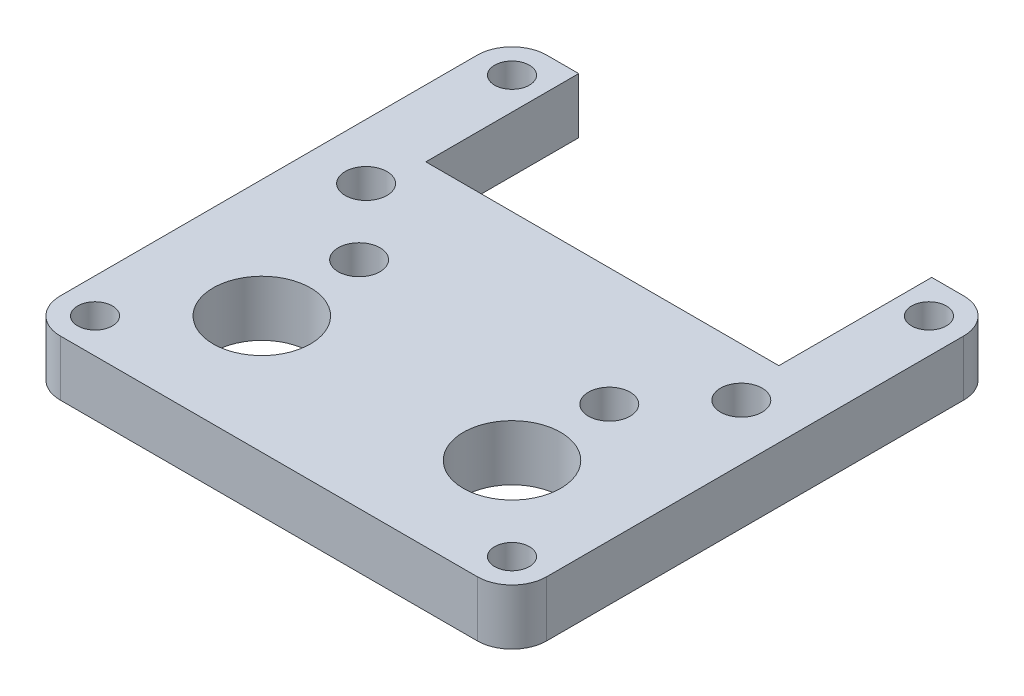
ISO-10303-21;
HEADER;
FILE_DESCRIPTION(('STEP AP214'),'2;1');
FILE_NAME('part.step','',(''),(''),'','','');
FILE_SCHEMA(('AUTOMOTIVE_DESIGN { 1 0 10303 214 1 1 1 1 }'));
ENDSEC;
DATA;
#1=APPLICATION_CONTEXT('core data for automotive mechanical design processes');
#2=APPLICATION_PROTOCOL_DEFINITION('international standard','automotive_design',2000,#1);
#3=PRODUCT_CONTEXT('',#1,'mechanical');
#4=PRODUCT('Part','Part','',(#3));
#5=PRODUCT_RELATED_PRODUCT_CATEGORY('part','',(#4));
#6=PRODUCT_DEFINITION_FORMATION('','',#4);
#7=PRODUCT_DEFINITION_CONTEXT('part definition',#1,'design');
#8=PRODUCT_DEFINITION('design','',#6,#7);
#9=PRODUCT_DEFINITION_SHAPE('','',#8);
#10=(LENGTH_UNIT() NAMED_UNIT(*) SI_UNIT(.MILLI.,.METRE.));
#11=(NAMED_UNIT(*) PLANE_ANGLE_UNIT() SI_UNIT($,.RADIAN.));
#12=(NAMED_UNIT(*) SI_UNIT($,.STERADIAN.) SOLID_ANGLE_UNIT());
#13=UNCERTAINTY_MEASURE_WITH_UNIT(LENGTH_MEASURE(1.E-05),#10,'distance_accuracy_value','');
#14=(GEOMETRIC_REPRESENTATION_CONTEXT(3) GLOBAL_UNCERTAINTY_ASSIGNED_CONTEXT((#13)) GLOBAL_UNIT_ASSIGNED_CONTEXT((#10,
#11,#12)) REPRESENTATION_CONTEXT('',''));
#15=CARTESIAN_POINT('',(0.,0.,0.));
#16=DIRECTION('',(0.,0.,1.));
#17=DIRECTION('',(1.,0.,0.));
#18=AXIS2_PLACEMENT_3D('',#15,#16,#17);
#19=CARTESIAN_POINT('',(-10.2,2.,-1.49999999996453));
#20=DIRECTION('',(0.,0.,-1.));
#21=DIRECTION('',(-1.,0.,0.));
#22=AXIS2_PLACEMENT_3D('',#19,#20,#21);
#23=CONICAL_SURFACE('',#22,1.02499999996762,1.02974425866215);
#24=CARTESIAN_POINT('',(-10.2,2.,-0.884117865496137));
#25=VERTEX_POINT('',#24);
#26=VERTEX_LOOP('',#25);
#27=FACE_BOUND('',#26,.T.);
#28=CARTESIAN_POINT('',(-10.2,2.,-1.5));
#29=DIRECTION('',(0.,0.,-1.));
#30=DIRECTION('',(-1.,0.,0.));
#31=AXIS2_PLACEMENT_3D('',#28,#29,#30);
#32=CIRCLE('',#31,1.025);
#33=CARTESIAN_POINT('',(-11.225,2.,-1.5));
#34=VERTEX_POINT('',#33);
#35=EDGE_CURVE('E147',#34,#34,#32,.T.);
#36=ORIENTED_EDGE('',*,*,#35,.T.);
#37=EDGE_LOOP('',(#36));
#38=FACE_BOUND('',#37,.T.);
#39=ADVANCED_FACE('F26',(#27,#38),#23,.F.);
#40=CARTESIAN_POINT('',(10.2,2.,-1.50000000002137));
#41=DIRECTION('',(0.,0.,-1.));
#42=DIRECTION('',(0.,1.,0.));
#43=AXIS2_PLACEMENT_3D('',#40,#41,#42);
#44=CONICAL_SURFACE('',#43,1.02500000002938,1.02974425867249);
#45=CARTESIAN_POINT('',(10.2,2.,-0.884117865496137));
#46=VERTEX_POINT('',#45);
#47=VERTEX_LOOP('',#46);
#48=FACE_BOUND('',#47,.T.);
#49=CARTESIAN_POINT('',(10.2,2.,-1.5));
#50=DIRECTION('',(0.,0.,-1.));
#51=DIRECTION('',(-1.,0.,0.));
#52=AXIS2_PLACEMENT_3D('',#49,#50,#51);
#53=CIRCLE('',#52,1.025);
#54=CARTESIAN_POINT('',(9.175,2.,-1.5));
#55=VERTEX_POINT('',#54);
#56=EDGE_CURVE('E150',#55,#55,#53,.T.);
#57=ORIENTED_EDGE('',*,*,#56,.T.);
#58=EDGE_LOOP('',(#57));
#59=FACE_BOUND('',#58,.T.);
#60=ADVANCED_FACE('F144',(#48,#59),#44,.F.);
#61=CARTESIAN_POINT('',(-10.2,2.,-6.5));
#62=DIRECTION('',(0.,0.,-1.));
#63=DIRECTION('',(-1.,0.,0.));
#64=AXIS2_PLACEMENT_3D('',#61,#62,#63);
#65=CYLINDRICAL_SURFACE('',#64,1.025);
#66=ORIENTED_EDGE('',*,*,#35,.F.);
#67=EDGE_LOOP('',(#66));
#68=FACE_BOUND('',#67,.T.);
#69=CARTESIAN_POINT('',(-10.2,2.,-6.5));
#70=DIRECTION('',(0.,0.,-1.));
#71=DIRECTION('',(-1.,0.,0.));
#72=AXIS2_PLACEMENT_3D('',#69,#70,#71);
#73=CIRCLE('',#72,1.025);
#74=CARTESIAN_POINT('',(-11.225,2.,-6.5));
#75=VERTEX_POINT('',#74);
#76=EDGE_CURVE('E243',#75,#75,#73,.T.);
#77=ORIENTED_EDGE('',*,*,#76,.T.);
#78=EDGE_LOOP('',(#77));
#79=FACE_BOUND('',#78,.T.);
#80=ADVANCED_FACE('F394',(#68,#79),#65,.F.);
#81=CARTESIAN_POINT('',(10.2,2.,-6.5));
#82=DIRECTION('',(0.,0.,-1.));
#83=DIRECTION('',(-1.,0.,0.));
#84=AXIS2_PLACEMENT_3D('',#81,#82,#83);
#85=CYLINDRICAL_SURFACE('',#84,1.025);
#86=ORIENTED_EDGE('',*,*,#56,.F.);
#87=EDGE_LOOP('',(#86));
#88=FACE_BOUND('',#87,.T.);
#89=CARTESIAN_POINT('',(10.2,2.,-6.5));
#90=DIRECTION('',(0.,0.,-1.));
#91=DIRECTION('',(-1.,0.,0.));
#92=AXIS2_PLACEMENT_3D('',#89,#90,#91);
#93=CIRCLE('',#92,1.025);
#94=CARTESIAN_POINT('',(9.175,2.,-6.5));
#95=VERTEX_POINT('',#94);
#96=EDGE_CURVE('E238',#95,#95,#93,.T.);
#97=ORIENTED_EDGE('',*,*,#96,.T.);
#98=EDGE_LOOP('',(#97));
#99=FACE_BOUND('',#98,.T.);
#100=ADVANCED_FACE('F390',(#88,#99),#85,.F.);
#101=CARTESIAN_POINT('',(17.5,0.,-17.5));
#102=DIRECTION('',(0.,-1.,0.));
#103=DIRECTION('',(0.,0.,-1.));
#104=AXIS2_PLACEMENT_3D('',#101,#102,#103);
#105=PLANE('',#104);
#106=CARTESIAN_POINT('',(-8.99999999999979,0.,9.));
#107=DIRECTION('',(0.,1.,0.));
#108=DIRECTION('',(0.,0.,1.));
#109=AXIS2_PLACEMENT_3D('',#106,#107,#108);
#110=CIRCLE('',#109,3.5);
#111=CARTESIAN_POINT('',(-8.99999999999979,0.,12.5));
#112=VERTEX_POINT('',#111);
#113=EDGE_CURVE('E248',#112,#112,#110,.T.);
#114=ORIENTED_EDGE('',*,*,#113,.T.);
#115=EDGE_LOOP('',(#114));
#116=FACE_BOUND('',#115,.T.);
#117=CARTESIAN_POINT('',(9.00000000000021,0.,9.));
#118=DIRECTION('',(0.,1.,0.));
#119=DIRECTION('',(0.,0.,1.));
#120=AXIS2_PLACEMENT_3D('',#117,#118,#119);
#121=CIRCLE('',#120,3.5);
#122=CARTESIAN_POINT('',(9.00000000000021,0.,12.5));
#123=VERTEX_POINT('',#122);
#124=EDGE_CURVE('E252',#123,#123,#121,.T.);
#125=ORIENTED_EDGE('',*,*,#124,.T.);
#126=EDGE_LOOP('',(#125));
#127=FACE_BOUND('',#126,.T.);
#128=DIRECTION('',(-1.,0.,0.));
#129=VECTOR('',#128,1.);
#130=CARTESIAN_POINT('',(-17.5,0.,17.5));
#131=LINE('',#130,#129);
#132=CARTESIAN_POINT('',(15.,0.,17.5));
#133=VERTEX_POINT('',#132);
#134=CARTESIAN_POINT('',(-15.,0.,17.5));
#135=VERTEX_POINT('',#134);
#136=EDGE_CURVE('E229',#133,#135,#131,.T.);
#137=ORIENTED_EDGE('',*,*,#136,.T.);
#138=CARTESIAN_POINT('',(-15.,0.,15.));
#139=DIRECTION('',(0.,-1.,0.));
#140=DIRECTION('',(0.,0.,-1.));
#141=AXIS2_PLACEMENT_3D('',#138,#139,#140);
#142=CIRCLE('',#141,2.5);
#143=CARTESIAN_POINT('',(-17.5,0.,15.));
#144=VERTEX_POINT('',#143);
#145=EDGE_CURVE('E225',#144,#135,#142,.F.);
#146=ORIENTED_EDGE('',*,*,#145,.F.);
#147=DIRECTION('',(0.,0.,-1.));
#148=VECTOR('',#147,1.);
#149=CARTESIAN_POINT('',(-17.5,0.,17.5));
#150=LINE('',#149,#148);
#151=CARTESIAN_POINT('',(-17.5,0.,-15.));
#152=VERTEX_POINT('',#151);
#153=EDGE_CURVE('E224',#144,#152,#150,.T.);
#154=ORIENTED_EDGE('',*,*,#153,.T.);
#155=CARTESIAN_POINT('',(-15.,0.,-15.));
#156=DIRECTION('',(0.,-1.,0.));
#157=DIRECTION('',(0.,0.,-1.));
#158=AXIS2_PLACEMENT_3D('',#155,#156,#157);
#159=CIRCLE('',#158,2.5);
#160=CARTESIAN_POINT('',(-15.,0.,-17.5));
#161=VERTEX_POINT('',#160);
#162=EDGE_CURVE('E220',#161,#152,#159,.F.);
#163=ORIENTED_EDGE('',*,*,#162,.F.);
#164=DIRECTION('',(1.,0.,0.));
#165=VECTOR('',#164,1.);
#166=CARTESIAN_POINT('',(-17.5,0.,-17.5));
#167=LINE('',#166,#165);
#168=CARTESIAN_POINT('',(-12.7,0.,-17.5));
#169=VERTEX_POINT('',#168);
#170=EDGE_CURVE('E219',#161,#169,#167,.T.);
#171=ORIENTED_EDGE('',*,*,#170,.T.);
#172=DIRECTION('',(0.,0.,1.));
#173=VECTOR('',#172,1.);
#174=CARTESIAN_POINT('',(-12.7,0.,-17.5));
#175=LINE('',#174,#173);
#176=CARTESIAN_POINT('',(-12.7,0.,-6.5));
#177=VERTEX_POINT('',#176);
#178=EDGE_CURVE('E247',#169,#177,#175,.T.);
#179=ORIENTED_EDGE('',*,*,#178,.T.);
#180=DIRECTION('',(1.,0.,0.));
#181=VECTOR('',#180,1.);
#182=CARTESIAN_POINT('',(-12.7,0.,-6.5));
#183=LINE('',#182,#181);
#184=CARTESIAN_POINT('',(12.7,0.,-6.5));
#185=VERTEX_POINT('',#184);
#186=EDGE_CURVE('E684',#177,#185,#183,.T.);
#187=ORIENTED_EDGE('',*,*,#186,.T.);
#188=DIRECTION('',(0.,0.,-1.));
#189=VECTOR('',#188,1.);
#190=CARTESIAN_POINT('',(12.7,0.,-17.5));
#191=LINE('',#190,#189);
#192=CARTESIAN_POINT('',(12.7,0.,-17.5));
#193=VERTEX_POINT('',#192);
#194=EDGE_CURVE('E114',#185,#193,#191,.T.);
#195=ORIENTED_EDGE('',*,*,#194,.T.);
#196=DIRECTION('',(1.,0.,0.));
#197=VECTOR('',#196,1.);
#198=CARTESIAN_POINT('',(-17.5,0.,-17.5));
#199=LINE('',#198,#197);
#200=CARTESIAN_POINT('',(15.,0.,-17.5));
#201=VERTEX_POINT('',#200);
#202=EDGE_CURVE('E237',#193,#201,#199,.T.);
#203=ORIENTED_EDGE('',*,*,#202,.T.);
#204=CARTESIAN_POINT('',(15.,0.,-15.));
#205=DIRECTION('',(0.,-1.,0.));
#206=DIRECTION('',(0.,0.,-1.));
#207=AXIS2_PLACEMENT_3D('',#204,#205,#206);
#208=CIRCLE('',#207,2.5);
#209=CARTESIAN_POINT('',(17.5,0.,-15.));
#210=VERTEX_POINT('',#209);
#211=EDGE_CURVE('E100',#210,#201,#208,.F.);
#212=ORIENTED_EDGE('',*,*,#211,.F.);
#213=DIRECTION('',(0.,0.,1.));
#214=VECTOR('',#213,1.);
#215=CARTESIAN_POINT('',(17.5,0.,17.5));
#216=LINE('',#215,#214);
#217=CARTESIAN_POINT('',(17.5,0.,15.));
#218=VERTEX_POINT('',#217);
#219=EDGE_CURVE('E233',#210,#218,#216,.T.);
#220=ORIENTED_EDGE('',*,*,#219,.T.);
#221=CARTESIAN_POINT('',(15.,0.,15.));
#222=DIRECTION('',(0.,-1.,0.));
#223=DIRECTION('',(0.,0.,-1.));
#224=AXIS2_PLACEMENT_3D('',#221,#222,#223);
#225=CIRCLE('',#224,2.5);
#226=EDGE_CURVE('E230',#133,#218,#225,.F.);
#227=ORIENTED_EDGE('',*,*,#226,.F.);
#228=EDGE_LOOP('',(#137,#146,#154,#163,#171,#179,#187,#195,#203,#212,#220,#227));
#229=FACE_BOUND('',#228,.T.);
#230=CARTESIAN_POINT('',(-8.99999999999979,0.,2.));
#231=DIRECTION('',(0.,1.,0.));
#232=DIRECTION('',(0.,0.,1.));
#233=AXIS2_PLACEMENT_3D('',#230,#231,#232);
#234=CIRCLE('',#233,1.5);
#235=CARTESIAN_POINT('',(-8.99999999999979,0.,3.5));
#236=VERTEX_POINT('',#235);
#237=EDGE_CURVE('E255',#236,#236,#234,.T.);
#238=ORIENTED_EDGE('',*,*,#237,.T.);
#239=EDGE_LOOP('',(#238));
#240=FACE_BOUND('',#239,.T.);
#241=CARTESIAN_POINT('',(9.00000000000021,0.,2.));
#242=DIRECTION('',(0.,1.,0.));
#243=DIRECTION('',(0.,0.,1.));
#244=AXIS2_PLACEMENT_3D('',#241,#242,#243);
#245=CIRCLE('',#244,1.5);
#246=CARTESIAN_POINT('',(9.00000000000021,0.,3.5));
#247=VERTEX_POINT('',#246);
#248=EDGE_CURVE('E259',#247,#247,#245,.T.);
#249=ORIENTED_EDGE('',*,*,#248,.T.);
#250=EDGE_LOOP('',(#249));
#251=FACE_BOUND('',#250,.T.);
#252=CARTESIAN_POINT('',(15.,0.,-15.));
#253=DIRECTION('',(0.,1.,0.));
#254=DIRECTION('',(0.,0.,1.));
#255=AXIS2_PLACEMENT_3D('',#252,#253,#254);
#256=CIRCLE('',#255,1.24999999999999);
#257=CARTESIAN_POINT('',(15.,0.,-13.75));
#258=VERTEX_POINT('',#257);
#259=EDGE_CURVE('E262',#258,#258,#256,.T.);
#260=ORIENTED_EDGE('',*,*,#259,.T.);
#261=EDGE_LOOP('',(#260));
#262=FACE_BOUND('',#261,.T.);
#263=CARTESIAN_POINT('',(-15.,0.,-15.));
#264=DIRECTION('',(0.,1.,0.));
#265=DIRECTION('',(0.,0.,1.));
#266=AXIS2_PLACEMENT_3D('',#263,#264,#265);
#267=CIRCLE('',#266,1.24999999999999);
#268=CARTESIAN_POINT('',(-15.,0.,-13.75));
#269=VERTEX_POINT('',#268);
#270=EDGE_CURVE('E266',#269,#269,#267,.T.);
#271=ORIENTED_EDGE('',*,*,#270,.T.);
#272=EDGE_LOOP('',(#271));
#273=FACE_BOUND('',#272,.T.);
#274=CARTESIAN_POINT('',(-15.,0.,15.));
#275=DIRECTION('',(0.,1.,0.));
#276=DIRECTION('',(0.,0.,1.));
#277=AXIS2_PLACEMENT_3D('',#274,#275,#276);
#278=CIRCLE('',#277,1.24999999999999);
#279=CARTESIAN_POINT('',(-15.,0.,16.25));
#280=VERTEX_POINT('',#279);
#281=EDGE_CURVE('E270',#280,#280,#278,.T.);
#282=ORIENTED_EDGE('',*,*,#281,.T.);
#283=EDGE_LOOP('',(#282));
#284=FACE_BOUND('',#283,.T.);
#285=CARTESIAN_POINT('',(15.,0.,15.));
#286=DIRECTION('',(0.,1.,0.));
#287=DIRECTION('',(0.,0.,1.));
#288=AXIS2_PLACEMENT_3D('',#285,#286,#287);
#289=CIRCLE('',#288,1.24999999999999);
#290=CARTESIAN_POINT('',(15.,0.,16.25));
#291=VERTEX_POINT('',#290);
#292=EDGE_CURVE('E274',#291,#291,#289,.T.);
#293=ORIENTED_EDGE('',*,*,#292,.T.);
#294=EDGE_LOOP('',(#293));
#295=FACE_BOUND('',#294,.T.);
#296=CARTESIAN_POINT('',(-13.5,0.,-3.));
#297=DIRECTION('',(0.,1.,0.));
#298=DIRECTION('',(0.,0.,1.));
#299=AXIS2_PLACEMENT_3D('',#296,#297,#298);
#300=CIRCLE('',#299,1.5);
#301=CARTESIAN_POINT('',(-13.5,0.,-1.50000000000001));
#302=VERTEX_POINT('',#301);
#303=EDGE_CURVE('E276',#302,#302,#300,.T.);
#304=ORIENTED_EDGE('',*,*,#303,.T.);
#305=EDGE_LOOP('',(#304));
#306=FACE_BOUND('',#305,.T.);
#307=CARTESIAN_POINT('',(13.5,0.,-3.));
#308=DIRECTION('',(0.,1.,0.));
#309=DIRECTION('',(0.,0.,1.));
#310=AXIS2_PLACEMENT_3D('',#307,#308,#309);
#311=CIRCLE('',#310,1.5);
#312=CARTESIAN_POINT('',(13.5,0.,-1.5));
#313=VERTEX_POINT('',#312);
#314=EDGE_CURVE('E29',#313,#313,#311,.T.);
#315=ORIENTED_EDGE('',*,*,#314,.T.);
#316=EDGE_LOOP('',(#315));
#317=FACE_BOUND('',#316,.T.);
#318=ADVANCED_FACE('F288',(#116,#127,#229,#240,#251,#262,#273,#284,#295,#306,#317),#105,.T.);
#319=CARTESIAN_POINT('',(13.5,-0.00100000000000013,-3.));
#320=DIRECTION('',(0.,1.,0.));
#321=DIRECTION('',(0.,0.,1.));
#322=AXIS2_PLACEMENT_3D('',#319,#320,#321);
#323=CYLINDRICAL_SURFACE('',#322,1.5);
#324=ORIENTED_EDGE('',*,*,#314,.F.);
#325=EDGE_LOOP('',(#324));
#326=FACE_BOUND('',#325,.T.);
#327=CARTESIAN_POINT('',(13.5,4.,-3.));
#328=DIRECTION('',(0.,1.,0.));
#329=DIRECTION('',(0.,0.,1.));
#330=AXIS2_PLACEMENT_3D('',#327,#328,#329);
#331=CIRCLE('',#330,1.5);
#332=CARTESIAN_POINT('',(13.5,4.,-1.5));
#333=VERTEX_POINT('',#332);
#334=EDGE_CURVE('E215',#333,#333,#331,.T.);
#335=ORIENTED_EDGE('',*,*,#334,.T.);
#336=EDGE_LOOP('',(#335));
#337=FACE_BOUND('',#336,.T.);
#338=ADVANCED_FACE('F290',(#326,#337),#323,.F.);
#339=CARTESIAN_POINT('',(-13.5,-0.00100000000000013,-3.));
#340=DIRECTION('',(0.,1.,0.));
#341=DIRECTION('',(0.,0.,1.));
#342=AXIS2_PLACEMENT_3D('',#339,#340,#341);
#343=CYLINDRICAL_SURFACE('',#342,1.5);
#344=ORIENTED_EDGE('',*,*,#303,.F.);
#345=EDGE_LOOP('',(#344));
#346=FACE_BOUND('',#345,.T.);
#347=CARTESIAN_POINT('',(-13.5,4.,-3.));
#348=DIRECTION('',(0.,1.,0.));
#349=DIRECTION('',(0.,0.,1.));
#350=AXIS2_PLACEMENT_3D('',#347,#348,#349);
#351=CIRCLE('',#350,1.5);
#352=CARTESIAN_POINT('',(-13.5,4.,-1.50000000000001));
#353=VERTEX_POINT('',#352);
#354=EDGE_CURVE('E211',#353,#353,#351,.T.);
#355=ORIENTED_EDGE('',*,*,#354,.T.);
#356=EDGE_LOOP('',(#355));
#357=FACE_BOUND('',#356,.T.);
#358=ADVANCED_FACE('F293',(#346,#357),#343,.F.);
#359=CARTESIAN_POINT('',(15.,4.,15.));
#360=DIRECTION('',(0.,1.,0.));
#361=DIRECTION('',(0.,0.,1.));
#362=AXIS2_PLACEMENT_3D('',#359,#360,#361);
#363=CYLINDRICAL_SURFACE('',#362,1.24999999999999);
#364=ORIENTED_EDGE('',*,*,#292,.F.);
#365=EDGE_LOOP('',(#364));
#366=FACE_BOUND('',#365,.T.);
#367=CARTESIAN_POINT('',(15.,4.,15.));
#368=DIRECTION('',(0.,1.,0.));
#369=DIRECTION('',(0.,0.,1.));
#370=AXIS2_PLACEMENT_3D('',#367,#368,#369);
#371=CIRCLE('',#370,1.24999999999999);
#372=CARTESIAN_POINT('',(15.,4.,16.25));
#373=VERTEX_POINT('',#372);
#374=EDGE_CURVE('E207',#373,#373,#371,.T.);
#375=ORIENTED_EDGE('',*,*,#374,.T.);
#376=EDGE_LOOP('',(#375));
#377=FACE_BOUND('',#376,.T.);
#378=ADVANCED_FACE('F380',(#366,#377),#363,.F.);
#379=CARTESIAN_POINT('',(-15.,4.,15.));
#380=DIRECTION('',(0.,1.,0.));
#381=DIRECTION('',(0.,0.,1.));
#382=AXIS2_PLACEMENT_3D('',#379,#380,#381);
#383=CYLINDRICAL_SURFACE('',#382,1.24999999999999);
#384=ORIENTED_EDGE('',*,*,#281,.F.);
#385=EDGE_LOOP('',(#384));
#386=FACE_BOUND('',#385,.T.);
#387=CARTESIAN_POINT('',(-15.,4.,15.));
#388=DIRECTION('',(0.,1.,0.));
#389=DIRECTION('',(0.,0.,1.));
#390=AXIS2_PLACEMENT_3D('',#387,#388,#389);
#391=CIRCLE('',#390,1.24999999999999);
#392=CARTESIAN_POINT('',(-15.,4.,16.25));
#393=VERTEX_POINT('',#392);
#394=EDGE_CURVE('E203',#393,#393,#391,.T.);
#395=ORIENTED_EDGE('',*,*,#394,.T.);
#396=EDGE_LOOP('',(#395));
#397=FACE_BOUND('',#396,.T.);
#398=ADVANCED_FACE('F376',(#386,#397),#383,.F.);
#399=CARTESIAN_POINT('',(-15.,4.,-15.));
#400=DIRECTION('',(0.,1.,0.));
#401=DIRECTION('',(0.,0.,1.));
#402=AXIS2_PLACEMENT_3D('',#399,#400,#401);
#403=CYLINDRICAL_SURFACE('',#402,1.24999999999999);
#404=ORIENTED_EDGE('',*,*,#270,.F.);
#405=EDGE_LOOP('',(#404));
#406=FACE_BOUND('',#405,.T.);
#407=CARTESIAN_POINT('',(-15.,4.,-15.));
#408=DIRECTION('',(0.,1.,0.));
#409=DIRECTION('',(0.,0.,1.));
#410=AXIS2_PLACEMENT_3D('',#407,#408,#409);
#411=CIRCLE('',#410,1.24999999999999);
#412=CARTESIAN_POINT('',(-15.,4.,-13.75));
#413=VERTEX_POINT('',#412);
#414=EDGE_CURVE('E199',#413,#413,#411,.T.);
#415=ORIENTED_EDGE('',*,*,#414,.T.);
#416=EDGE_LOOP('',(#415));
#417=FACE_BOUND('',#416,.T.);
#418=ADVANCED_FACE('F372',(#406,#417),#403,.F.);
#419=CARTESIAN_POINT('',(15.,4.,-15.));
#420=DIRECTION('',(0.,1.,0.));
#421=DIRECTION('',(0.,0.,1.));
#422=AXIS2_PLACEMENT_3D('',#419,#420,#421);
#423=CYLINDRICAL_SURFACE('',#422,1.24999999999999);
#424=ORIENTED_EDGE('',*,*,#259,.F.);
#425=EDGE_LOOP('',(#424));
#426=FACE_BOUND('',#425,.T.);
#427=CARTESIAN_POINT('',(15.,4.,-15.));
#428=DIRECTION('',(0.,1.,0.));
#429=DIRECTION('',(0.,0.,1.));
#430=AXIS2_PLACEMENT_3D('',#427,#428,#429);
#431=CIRCLE('',#430,1.24999999999999);
#432=CARTESIAN_POINT('',(15.,4.,-13.75));
#433=VERTEX_POINT('',#432);
#434=EDGE_CURVE('E195',#433,#433,#431,.T.);
#435=ORIENTED_EDGE('',*,*,#434,.T.);
#436=EDGE_LOOP('',(#435));
#437=FACE_BOUND('',#436,.T.);
#438=ADVANCED_FACE('F368',(#426,#437),#423,.F.);
#439=CARTESIAN_POINT('',(9.00000000000021,0.,2.));
#440=DIRECTION('',(0.,1.,0.));
#441=DIRECTION('',(0.,0.,1.));
#442=AXIS2_PLACEMENT_3D('',#439,#440,#441);
#443=CYLINDRICAL_SURFACE('',#442,1.5);
#444=ORIENTED_EDGE('',*,*,#248,.F.);
#445=EDGE_LOOP('',(#444));
#446=FACE_BOUND('',#445,.T.);
#447=CARTESIAN_POINT('',(9.00000000000021,4.,2.));
#448=DIRECTION('',(0.,1.,0.));
#449=DIRECTION('',(0.,0.,1.));
#450=AXIS2_PLACEMENT_3D('',#447,#448,#449);
#451=CIRCLE('',#450,1.5);
#452=CARTESIAN_POINT('',(9.00000000000021,4.,3.5));
#453=VERTEX_POINT('',#452);
#454=EDGE_CURVE('E191',#453,#453,#451,.T.);
#455=ORIENTED_EDGE('',*,*,#454,.T.);
#456=EDGE_LOOP('',(#455));
#457=FACE_BOUND('',#456,.T.);
#458=ADVANCED_FACE('F364',(#446,#457),#443,.F.);
#459=CARTESIAN_POINT('',(-8.99999999999979,0.,2.));
#460=DIRECTION('',(0.,1.,0.));
#461=DIRECTION('',(0.,0.,1.));
#462=AXIS2_PLACEMENT_3D('',#459,#460,#461);
#463=CYLINDRICAL_SURFACE('',#462,1.5);
#464=ORIENTED_EDGE('',*,*,#237,.F.);
#465=EDGE_LOOP('',(#464));
#466=FACE_BOUND('',#465,.T.);
#467=CARTESIAN_POINT('',(-8.99999999999979,4.,2.));
#468=DIRECTION('',(0.,1.,0.));
#469=DIRECTION('',(0.,0.,1.));
#470=AXIS2_PLACEMENT_3D('',#467,#468,#469);
#471=CIRCLE('',#470,1.5);
#472=CARTESIAN_POINT('',(-8.99999999999979,4.,3.5));
#473=VERTEX_POINT('',#472);
#474=EDGE_CURVE('E187',#473,#473,#471,.T.);
#475=ORIENTED_EDGE('',*,*,#474,.T.);
#476=EDGE_LOOP('',(#475));
#477=FACE_BOUND('',#476,.T.);
#478=ADVANCED_FACE('F360',(#466,#477),#463,.F.);
#479=CARTESIAN_POINT('',(9.00000000000021,0.,9.));
#480=DIRECTION('',(0.,1.,0.));
#481=DIRECTION('',(0.,0.,1.));
#482=AXIS2_PLACEMENT_3D('',#479,#480,#481);
#483=CYLINDRICAL_SURFACE('',#482,3.5);
#484=ORIENTED_EDGE('',*,*,#124,.F.);
#485=EDGE_LOOP('',(#484));
#486=FACE_BOUND('',#485,.T.);
#487=CARTESIAN_POINT('',(9.00000000000021,4.,9.));
#488=DIRECTION('',(0.,1.,0.));
#489=DIRECTION('',(0.,0.,1.));
#490=AXIS2_PLACEMENT_3D('',#487,#488,#489);
#491=CIRCLE('',#490,3.5);
#492=CARTESIAN_POINT('',(9.00000000000021,4.,12.5));
#493=VERTEX_POINT('',#492);
#494=EDGE_CURVE('E183',#493,#493,#491,.T.);
#495=ORIENTED_EDGE('',*,*,#494,.T.);
#496=EDGE_LOOP('',(#495));
#497=FACE_BOUND('',#496,.T.);
#498=ADVANCED_FACE('F356',(#486,#497),#483,.F.);
#499=CARTESIAN_POINT('',(-8.99999999999979,0.,9.));
#500=DIRECTION('',(0.,1.,0.));
#501=DIRECTION('',(0.,0.,1.));
#502=AXIS2_PLACEMENT_3D('',#499,#500,#501);
#503=CYLINDRICAL_SURFACE('',#502,3.5);
#504=ORIENTED_EDGE('',*,*,#113,.F.);
#505=EDGE_LOOP('',(#504));
#506=FACE_BOUND('',#505,.T.);
#507=CARTESIAN_POINT('',(-8.99999999999979,4.,9.));
#508=DIRECTION('',(0.,1.,0.));
#509=DIRECTION('',(0.,0.,1.));
#510=AXIS2_PLACEMENT_3D('',#507,#508,#509);
#511=CIRCLE('',#510,3.5);
#512=CARTESIAN_POINT('',(-8.99999999999979,4.,12.5));
#513=VERTEX_POINT('',#512);
#514=EDGE_CURVE('E178',#513,#513,#511,.T.);
#515=ORIENTED_EDGE('',*,*,#514,.T.);
#516=EDGE_LOOP('',(#515));
#517=FACE_BOUND('',#516,.T.);
#518=ADVANCED_FACE('F352',(#506,#517),#503,.F.);
#519=CARTESIAN_POINT('',(-12.7,0.,-17.5));
#520=DIRECTION('',(-1.,0.,0.));
#521=DIRECTION('',(0.,0.,1.));
#522=AXIS2_PLACEMENT_3D('',#519,#520,#521);
#523=PLANE('',#522);
#524=DIRECTION('',(0.,1.,0.));
#525=VECTOR('',#524,1.);
#526=CARTESIAN_POINT('',(-12.7,0.,-6.5));
#527=LINE('',#526,#525);
#528=CARTESIAN_POINT('',(-12.7,4.,-6.5));
#529=VERTEX_POINT('',#528);
#530=EDGE_CURVE('E242',#529,#177,#527,.F.);
#531=ORIENTED_EDGE('',*,*,#530,.T.);
#532=ORIENTED_EDGE('',*,*,#178,.F.);
#533=DIRECTION('',(0.,1.,0.));
#534=VECTOR('',#533,1.);
#535=CARTESIAN_POINT('',(-12.7,4.,-17.5));
#536=LINE('',#535,#534);
#537=CARTESIAN_POINT('',(-12.7,4.,-17.5));
#538=VERTEX_POINT('',#537);
#539=EDGE_CURVE('E654',#169,#538,#536,.T.);
#540=ORIENTED_EDGE('',*,*,#539,.T.);
#541=DIRECTION('',(0.,0.,-1.));
#542=VECTOR('',#541,1.);
#543=CARTESIAN_POINT('',(-12.7,4.,-17.5));
#544=LINE('',#543,#542);
#545=EDGE_CURVE('E182',#538,#529,#544,.F.);
#546=ORIENTED_EDGE('',*,*,#545,.T.);
#547=EDGE_LOOP('',(#531,#532,#540,#546));
#548=FACE_BOUND('',#547,.T.);
#549=ADVANCED_FACE('F348',(#548),#523,.F.);
#550=CARTESIAN_POINT('',(-12.7,0.,-6.5));
#551=DIRECTION('',(0.,0.,1.));
#552=DIRECTION('',(1.,0.,0.));
#553=AXIS2_PLACEMENT_3D('',#550,#551,#552);
#554=PLANE('',#553);
#555=DIRECTION('',(0.,1.,0.));
#556=VECTOR('',#555,1.);
#557=CARTESIAN_POINT('',(12.7,0.,-6.5));
#558=LINE('',#557,#556);
#559=CARTESIAN_POINT('',(12.7,4.,-6.5));
#560=VERTEX_POINT('',#559);
#561=EDGE_CURVE('E681',#560,#185,#558,.F.);
#562=ORIENTED_EDGE('',*,*,#561,.T.);
#563=ORIENTED_EDGE('',*,*,#186,.F.);
#564=ORIENTED_EDGE('',*,*,#530,.F.);
#565=DIRECTION('',(1.,0.,0.));
#566=VECTOR('',#565,1.);
#567=CARTESIAN_POINT('',(17.5,4.,-6.5));
#568=LINE('',#567,#566);
#569=EDGE_CURVE('E661',#529,#560,#568,.T.);
#570=ORIENTED_EDGE('',*,*,#569,.T.);
#571=EDGE_LOOP('',(#562,#563,#564,#570));
#572=FACE_BOUND('',#571,.T.);
#573=ORIENTED_EDGE('',*,*,#96,.F.);
#574=EDGE_LOOP('',(#573));
#575=FACE_BOUND('',#574,.T.);
#576=ORIENTED_EDGE('',*,*,#76,.F.);
#577=EDGE_LOOP('',(#576));
#578=FACE_BOUND('',#577,.T.);
#579=ADVANCED_FACE('F344',(#572,#575,#578),#554,.F.);
#580=CARTESIAN_POINT('',(12.7,0.,-17.5));
#581=DIRECTION('',(1.,0.,0.));
#582=DIRECTION('',(0.,0.,-1.));
#583=AXIS2_PLACEMENT_3D('',#580,#581,#582);
#584=PLANE('',#583);
#585=DIRECTION('',(0.,1.,0.));
#586=VECTOR('',#585,1.);
#587=CARTESIAN_POINT('',(12.7,4.,-17.5));
#588=LINE('',#587,#586);
#589=CARTESIAN_POINT('',(12.7,4.,-17.5));
#590=VERTEX_POINT('',#589);
#591=EDGE_CURVE('E675',#590,#193,#588,.F.);
#592=ORIENTED_EDGE('',*,*,#591,.T.);
#593=ORIENTED_EDGE('',*,*,#194,.F.);
#594=ORIENTED_EDGE('',*,*,#561,.F.);
#595=DIRECTION('',(0.,0.,-1.));
#596=VECTOR('',#595,1.);
#597=CARTESIAN_POINT('',(12.7,4.,-17.5));
#598=LINE('',#597,#596);
#599=EDGE_CURVE('E651',#560,#590,#598,.T.);
#600=ORIENTED_EDGE('',*,*,#599,.T.);
#601=EDGE_LOOP('',(#592,#593,#594,#600));
#602=FACE_BOUND('',#601,.T.);
#603=ADVANCED_FACE('F340',(#602),#584,.F.);
#604=CARTESIAN_POINT('',(-17.5,4.,-17.5));
#605=DIRECTION('',(0.,0.,1.));
#606=DIRECTION('',(1.,0.,0.));
#607=AXIS2_PLACEMENT_3D('',#604,#605,#606);
#608=PLANE('',#607);
#609=DIRECTION('',(0.,-1.,0.));
#610=VECTOR('',#609,1.);
#611=CARTESIAN_POINT('',(15.,4.,-17.5));
#612=LINE('',#611,#610);
#613=CARTESIAN_POINT('',(15.,4.,-17.5));
#614=VERTEX_POINT('',#613);
#615=EDGE_CURVE('E236',#201,#614,#612,.F.);
#616=ORIENTED_EDGE('',*,*,#615,.F.);
#617=ORIENTED_EDGE('',*,*,#202,.F.);
#618=ORIENTED_EDGE('',*,*,#591,.F.);
#619=DIRECTION('',(1.,0.,0.));
#620=VECTOR('',#619,1.);
#621=CARTESIAN_POINT('',(17.5,4.,-17.5));
#622=LINE('',#621,#620);
#623=EDGE_CURVE('E177',#590,#614,#622,.T.);
#624=ORIENTED_EDGE('',*,*,#623,.T.);
#625=EDGE_LOOP('',(#616,#617,#618,#624));
#626=FACE_BOUND('',#625,.T.);
#627=ADVANCED_FACE('F337',(#626),#608,.F.);
#628=CARTESIAN_POINT('',(15.,4.,-15.));
#629=DIRECTION('',(0.,-1.,0.));
#630=DIRECTION('',(0.,0.,-1.));
#631=AXIS2_PLACEMENT_3D('',#628,#629,#630);
#632=CYLINDRICAL_SURFACE('',#631,2.5);
#633=ORIENTED_EDGE('',*,*,#211,.T.);
#634=ORIENTED_EDGE('',*,*,#615,.T.);
#635=CARTESIAN_POINT('',(15.,4.,-15.));
#636=DIRECTION('',(0.,-1.,0.));
#637=DIRECTION('',(0.,0.,-1.));
#638=AXIS2_PLACEMENT_3D('',#635,#636,#637);
#639=CIRCLE('',#638,2.5);
#640=CARTESIAN_POINT('',(17.5,4.,-15.));
#641=VERTEX_POINT('',#640);
#642=EDGE_CURVE('E173',#614,#641,#639,.T.);
#643=ORIENTED_EDGE('',*,*,#642,.T.);
#644=DIRECTION('',(0.,1.,0.));
#645=VECTOR('',#644,1.);
#646=CARTESIAN_POINT('',(17.5,4.,-15.));
#647=LINE('',#646,#645);
#648=EDGE_CURVE('E671',#641,#210,#647,.F.);
#649=ORIENTED_EDGE('',*,*,#648,.T.);
#650=EDGE_LOOP('',(#633,#634,#643,#649));
#651=FACE_BOUND('',#650,.T.);
#652=ADVANCED_FACE('F333',(#651),#632,.T.);
#653=CARTESIAN_POINT('',(17.5,4.,17.5));
#654=DIRECTION('',(-1.,0.,0.));
#655=DIRECTION('',(0.,0.,1.));
#656=AXIS2_PLACEMENT_3D('',#653,#654,#655);
#657=PLANE('',#656);
#658=DIRECTION('',(0.,-1.,0.));
#659=VECTOR('',#658,1.);
#660=CARTESIAN_POINT('',(17.5,4.,15.));
#661=LINE('',#660,#659);
#662=CARTESIAN_POINT('',(17.5,4.,15.));
#663=VERTEX_POINT('',#662);
#664=EDGE_CURVE('E232',#218,#663,#661,.F.);
#665=ORIENTED_EDGE('',*,*,#664,.F.);
#666=ORIENTED_EDGE('',*,*,#219,.F.);
#667=ORIENTED_EDGE('',*,*,#648,.F.);
#668=DIRECTION('',(0.,0.,-1.));
#669=VECTOR('',#668,1.);
#670=CARTESIAN_POINT('',(17.5,4.,-17.5));
#671=LINE('',#670,#669);
#672=EDGE_CURVE('E172',#641,#663,#671,.F.);
#673=ORIENTED_EDGE('',*,*,#672,.T.);
#674=EDGE_LOOP('',(#665,#666,#667,#673));
#675=FACE_BOUND('',#674,.T.);
#676=ADVANCED_FACE('F329',(#675),#657,.F.);
#677=CARTESIAN_POINT('',(15.,4.,15.));
#678=DIRECTION('',(0.,-1.,0.));
#679=DIRECTION('',(0.,0.,-1.));
#680=AXIS2_PLACEMENT_3D('',#677,#678,#679);
#681=CYLINDRICAL_SURFACE('',#680,2.5);
#682=ORIENTED_EDGE('',*,*,#226,.T.);
#683=ORIENTED_EDGE('',*,*,#664,.T.);
#684=CARTESIAN_POINT('',(15.,4.,15.));
#685=DIRECTION('',(0.,-1.,0.));
#686=DIRECTION('',(0.,0.,-1.));
#687=AXIS2_PLACEMENT_3D('',#684,#685,#686);
#688=CIRCLE('',#687,2.5);
#689=CARTESIAN_POINT('',(15.,4.,17.5));
#690=VERTEX_POINT('',#689);
#691=EDGE_CURVE('E168',#663,#690,#688,.T.);
#692=ORIENTED_EDGE('',*,*,#691,.T.);
#693=DIRECTION('',(0.,1.,0.));
#694=VECTOR('',#693,1.);
#695=CARTESIAN_POINT('',(15.,4.,17.5));
#696=LINE('',#695,#694);
#697=EDGE_CURVE('E666',#690,#133,#696,.F.);
#698=ORIENTED_EDGE('',*,*,#697,.T.);
#699=EDGE_LOOP('',(#682,#683,#692,#698));
#700=FACE_BOUND('',#699,.T.);
#701=ADVANCED_FACE('F325',(#700),#681,.T.);
#702=CARTESIAN_POINT('',(-17.5,4.,17.5));
#703=DIRECTION('',(0.,0.,-1.));
#704=DIRECTION('',(-1.,0.,0.));
#705=AXIS2_PLACEMENT_3D('',#702,#703,#704);
#706=PLANE('',#705);
#707=DIRECTION('',(0.,-1.,0.));
#708=VECTOR('',#707,1.);
#709=CARTESIAN_POINT('',(-15.,4.,17.5));
#710=LINE('',#709,#708);
#711=CARTESIAN_POINT('',(-15.,4.,17.5));
#712=VERTEX_POINT('',#711);
#713=EDGE_CURVE('E228',#135,#712,#710,.F.);
#714=ORIENTED_EDGE('',*,*,#713,.F.);
#715=ORIENTED_EDGE('',*,*,#136,.F.);
#716=ORIENTED_EDGE('',*,*,#697,.F.);
#717=DIRECTION('',(1.,0.,0.));
#718=VECTOR('',#717,1.);
#719=CARTESIAN_POINT('',(17.5,4.,17.5));
#720=LINE('',#719,#718);
#721=EDGE_CURVE('E167',#690,#712,#720,.F.);
#722=ORIENTED_EDGE('',*,*,#721,.T.);
#723=EDGE_LOOP('',(#714,#715,#716,#722));
#724=FACE_BOUND('',#723,.T.);
#725=ADVANCED_FACE('F321',(#724),#706,.F.);
#726=CARTESIAN_POINT('',(-15.,4.,15.));
#727=DIRECTION('',(0.,-1.,0.));
#728=DIRECTION('',(0.,0.,-1.));
#729=AXIS2_PLACEMENT_3D('',#726,#727,#728);
#730=CYLINDRICAL_SURFACE('',#729,2.5);
#731=ORIENTED_EDGE('',*,*,#145,.T.);
#732=ORIENTED_EDGE('',*,*,#713,.T.);
#733=CARTESIAN_POINT('',(-15.,4.,15.));
#734=DIRECTION('',(0.,-1.,0.));
#735=DIRECTION('',(0.,0.,-1.));
#736=AXIS2_PLACEMENT_3D('',#733,#734,#735);
#737=CIRCLE('',#736,2.5);
#738=CARTESIAN_POINT('',(-17.5,4.,15.));
#739=VERTEX_POINT('',#738);
#740=EDGE_CURVE('E163',#712,#739,#737,.T.);
#741=ORIENTED_EDGE('',*,*,#740,.T.);
#742=DIRECTION('',(0.,1.,0.));
#743=VECTOR('',#742,1.);
#744=CARTESIAN_POINT('',(-17.5,4.,15.));
#745=LINE('',#744,#743);
#746=EDGE_CURVE('E631',#739,#144,#745,.F.);
#747=ORIENTED_EDGE('',*,*,#746,.T.);
#748=EDGE_LOOP('',(#731,#732,#741,#747));
#749=FACE_BOUND('',#748,.T.);
#750=ADVANCED_FACE('F317',(#749),#730,.T.);
#751=CARTESIAN_POINT('',(-17.5,4.,17.5));
#752=DIRECTION('',(1.,0.,0.));
#753=DIRECTION('',(0.,0.,-1.));
#754=AXIS2_PLACEMENT_3D('',#751,#752,#753);
#755=PLANE('',#754);
#756=DIRECTION('',(0.,-1.,0.));
#757=VECTOR('',#756,1.);
#758=CARTESIAN_POINT('',(-17.5,4.,-15.));
#759=LINE('',#758,#757);
#760=CARTESIAN_POINT('',(-17.5,4.,-15.));
#761=VERTEX_POINT('',#760);
#762=EDGE_CURVE('E223',#152,#761,#759,.F.);
#763=ORIENTED_EDGE('',*,*,#762,.F.);
#764=ORIENTED_EDGE('',*,*,#153,.F.);
#765=ORIENTED_EDGE('',*,*,#746,.F.);
#766=DIRECTION('',(0.,0.,-1.));
#767=VECTOR('',#766,1.);
#768=CARTESIAN_POINT('',(-17.5,4.,-17.5));
#769=LINE('',#768,#767);
#770=EDGE_CURVE('E162',#739,#761,#769,.T.);
#771=ORIENTED_EDGE('',*,*,#770,.T.);
#772=EDGE_LOOP('',(#763,#764,#765,#771));
#773=FACE_BOUND('',#772,.T.);
#774=ADVANCED_FACE('F313',(#773),#755,.F.);
#775=CARTESIAN_POINT('',(-15.,4.,-15.));
#776=DIRECTION('',(0.,-1.,0.));
#777=DIRECTION('',(0.,0.,-1.));
#778=AXIS2_PLACEMENT_3D('',#775,#776,#777);
#779=CYLINDRICAL_SURFACE('',#778,2.5);
#780=ORIENTED_EDGE('',*,*,#162,.T.);
#781=ORIENTED_EDGE('',*,*,#762,.T.);
#782=CARTESIAN_POINT('',(-15.,4.,-15.));
#783=DIRECTION('',(0.,-1.,0.));
#784=DIRECTION('',(0.,0.,-1.));
#785=AXIS2_PLACEMENT_3D('',#782,#783,#784);
#786=CIRCLE('',#785,2.5);
#787=CARTESIAN_POINT('',(-15.,4.,-17.5));
#788=VERTEX_POINT('',#787);
#789=EDGE_CURVE('E35',#761,#788,#786,.T.);
#790=ORIENTED_EDGE('',*,*,#789,.T.);
#791=DIRECTION('',(0.,1.,0.));
#792=VECTOR('',#791,1.);
#793=CARTESIAN_POINT('',(-15.,4.,-17.5));
#794=LINE('',#793,#792);
#795=EDGE_CURVE('E43',#788,#161,#794,.F.);
#796=ORIENTED_EDGE('',*,*,#795,.T.);
#797=EDGE_LOOP('',(#780,#781,#790,#796));
#798=FACE_BOUND('',#797,.T.);
#799=ADVANCED_FACE('F306',(#798),#779,.T.);
#800=CARTESIAN_POINT('',(-17.5,4.,-17.5));
#801=DIRECTION('',(0.,0.,1.));
#802=DIRECTION('',(1.,0.,0.));
#803=AXIS2_PLACEMENT_3D('',#800,#801,#802);
#804=PLANE('',#803);
#805=ORIENTED_EDGE('',*,*,#795,.F.);
#806=DIRECTION('',(1.,0.,0.));
#807=VECTOR('',#806,1.);
#808=CARTESIAN_POINT('',(17.5,4.,-17.5));
#809=LINE('',#808,#807);
#810=EDGE_CURVE('E13',#788,#538,#809,.T.);
#811=ORIENTED_EDGE('',*,*,#810,.T.);
#812=ORIENTED_EDGE('',*,*,#539,.F.);
#813=ORIENTED_EDGE('',*,*,#170,.F.);
#814=EDGE_LOOP('',(#805,#811,#812,#813));
#815=FACE_BOUND('',#814,.T.);
#816=ADVANCED_FACE('F299',(#815),#804,.F.);
#817=CARTESIAN_POINT('',(17.5,4.,-17.5));
#818=DIRECTION('',(0.,-1.,0.));
#819=DIRECTION('',(0.,0.,-1.));
#820=AXIS2_PLACEMENT_3D('',#817,#818,#819);
#821=PLANE('',#820);
#822=ORIENTED_EDGE('',*,*,#789,.F.);
#823=ORIENTED_EDGE('',*,*,#770,.F.);
#824=ORIENTED_EDGE('',*,*,#740,.F.);
#825=ORIENTED_EDGE('',*,*,#721,.F.);
#826=ORIENTED_EDGE('',*,*,#691,.F.);
#827=ORIENTED_EDGE('',*,*,#672,.F.);
#828=ORIENTED_EDGE('',*,*,#642,.F.);
#829=ORIENTED_EDGE('',*,*,#623,.F.);
#830=ORIENTED_EDGE('',*,*,#599,.F.);
#831=ORIENTED_EDGE('',*,*,#569,.F.);
#832=ORIENTED_EDGE('',*,*,#545,.F.);
#833=ORIENTED_EDGE('',*,*,#810,.F.);
#834=EDGE_LOOP('',(#822,#823,#824,#825,#826,#827,#828,#829,#830,#831,#832,#833));
#835=FACE_BOUND('',#834,.T.);
#836=ORIENTED_EDGE('',*,*,#514,.F.);
#837=EDGE_LOOP('',(#836));
#838=FACE_BOUND('',#837,.T.);
#839=ORIENTED_EDGE('',*,*,#494,.F.);
#840=EDGE_LOOP('',(#839));
#841=FACE_BOUND('',#840,.T.);
#842=ORIENTED_EDGE('',*,*,#474,.F.);
#843=EDGE_LOOP('',(#842));
#844=FACE_BOUND('',#843,.T.);
#845=ORIENTED_EDGE('',*,*,#454,.F.);
#846=EDGE_LOOP('',(#845));
#847=FACE_BOUND('',#846,.T.);
#848=ORIENTED_EDGE('',*,*,#434,.F.);
#849=EDGE_LOOP('',(#848));
#850=FACE_BOUND('',#849,.T.);
#851=ORIENTED_EDGE('',*,*,#414,.F.);
#852=EDGE_LOOP('',(#851));
#853=FACE_BOUND('',#852,.T.);
#854=ORIENTED_EDGE('',*,*,#394,.F.);
#855=EDGE_LOOP('',(#854));
#856=FACE_BOUND('',#855,.T.);
#857=ORIENTED_EDGE('',*,*,#374,.F.);
#858=EDGE_LOOP('',(#857));
#859=FACE_BOUND('',#858,.T.);
#860=ORIENTED_EDGE('',*,*,#354,.F.);
#861=EDGE_LOOP('',(#860));
#862=FACE_BOUND('',#861,.T.);
#863=ORIENTED_EDGE('',*,*,#334,.F.);
#864=EDGE_LOOP('',(#863));
#865=FACE_BOUND('',#864,.T.);
#866=ADVANCED_FACE('F297',(#835,#838,#841,#844,#847,#850,#853,#856,#859,#862,#865),#821,.F.);
#867=CLOSED_SHELL('',(#39,#60,#80,#100,#318,#338,#358,#378,#398,#418,#438,#458,#478,#498,#518,
#549,#579,#603,#627,#652,#676,#701,#725,#750,#774,#799,#816,#866));
#868=MANIFOLD_SOLID_BREP('B1',#867);
#869=ADVANCED_BREP_SHAPE_REPRESENTATION('',(#18,#868),#14);
#870=SHAPE_DEFINITION_REPRESENTATION(#9,#869);
ENDSEC;
END-ISO-10303-21;
